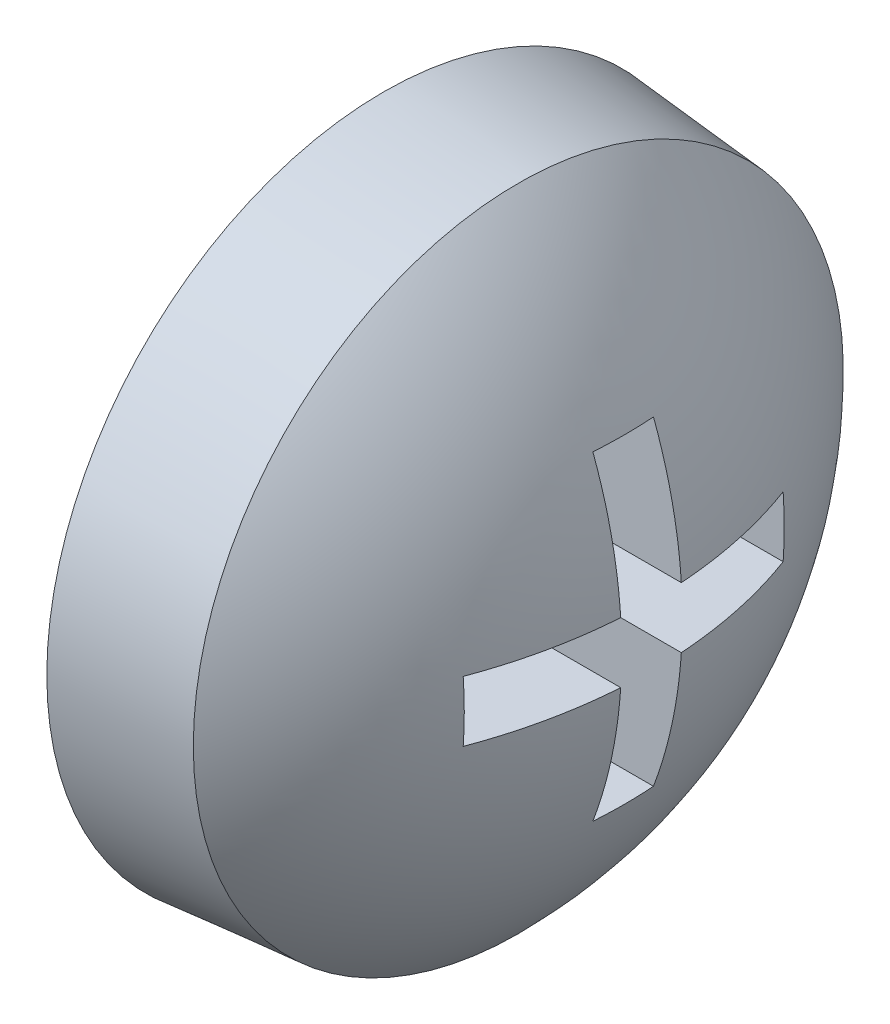
ISO-10303-21;
HEADER;
FILE_DESCRIPTION(('STEP AP214'),'2;1');
FILE_NAME('part.step','',(''),(''),'','','');
FILE_SCHEMA(('AUTOMOTIVE_DESIGN { 1 0 10303 214 1 1 1 1 }'));
ENDSEC;
DATA;
#1=APPLICATION_CONTEXT('core data for automotive mechanical design processes');
#2=APPLICATION_PROTOCOL_DEFINITION('international standard','automotive_design',2000,#1);
#3=PRODUCT_CONTEXT('',#1,'mechanical');
#4=PRODUCT('Part','Part','',(#3));
#5=PRODUCT_RELATED_PRODUCT_CATEGORY('part','',(#4));
#6=PRODUCT_DEFINITION_FORMATION('','',#4);
#7=PRODUCT_DEFINITION_CONTEXT('part definition',#1,'design');
#8=PRODUCT_DEFINITION('design','',#6,#7);
#9=PRODUCT_DEFINITION_SHAPE('','',#8);
#10=(LENGTH_UNIT() NAMED_UNIT(*) SI_UNIT(.MILLI.,.METRE.));
#11=(NAMED_UNIT(*) PLANE_ANGLE_UNIT() SI_UNIT($,.RADIAN.));
#12=(NAMED_UNIT(*) SI_UNIT($,.STERADIAN.) SOLID_ANGLE_UNIT());
#13=UNCERTAINTY_MEASURE_WITH_UNIT(LENGTH_MEASURE(1.E-05),#10,'distance_accuracy_value','');
#14=(GEOMETRIC_REPRESENTATION_CONTEXT(3) GLOBAL_UNCERTAINTY_ASSIGNED_CONTEXT((#13)) GLOBAL_UNIT_ASSIGNED_CONTEXT((#10,
#11,#12)) REPRESENTATION_CONTEXT('',''));
#15=CARTESIAN_POINT('',(0.,0.,0.));
#16=DIRECTION('',(0.,0.,1.));
#17=DIRECTION('',(1.,0.,0.));
#18=AXIS2_PLACEMENT_3D('',#15,#16,#17);
#19=CARTESIAN_POINT('',(103.933333333333,6.9,10.));
#20=DIRECTION('',(1.,0.,0.));
#21=DIRECTION('',(0.,0.,-1.));
#22=AXIS2_PLACEMENT_3D('',#19,#20,#21);
#23=PLANE('',#22);
#24=DIRECTION('',(0.,0.,1.));
#25=VECTOR('',#24,1.);
#26=CARTESIAN_POINT('',(103.933333333333,5.95,10.));
#27=LINE('',#26,#25);
#28=CARTESIAN_POINT('',(103.933333333333,5.95,9.82));
#29=VERTEX_POINT('',#28);
#30=CARTESIAN_POINT('',(103.933333333333,5.95,10.18));
#31=VERTEX_POINT('',#30);
#32=EDGE_CURVE('E293',#29,#31,#27,.T.);
#33=ORIENTED_EDGE('',*,*,#32,.F.);
#34=DIRECTION('',(0.,1.,0.));
#35=VECTOR('',#34,1.);
#36=CARTESIAN_POINT('',(103.933333333333,6.9,9.82));
#37=LINE('',#36,#35);
#38=CARTESIAN_POINT('',(103.933333333333,6.72,9.82));
#39=VERTEX_POINT('',#38);
#40=EDGE_CURVE('E298',#39,#29,#37,.F.);
#41=ORIENTED_EDGE('',*,*,#40,.F.);
#42=DIRECTION('',(0.,0.,1.));
#43=VECTOR('',#42,1.);
#44=CARTESIAN_POINT('',(103.933333333333,6.72,10.));
#45=LINE('',#44,#43);
#46=CARTESIAN_POINT('',(103.933333333333,6.72,9.05));
#47=VERTEX_POINT('',#46);
#48=EDGE_CURVE('E303',#47,#39,#45,.T.);
#49=ORIENTED_EDGE('',*,*,#48,.F.);
#50=DIRECTION('',(0.,1.,0.));
#51=VECTOR('',#50,1.);
#52=CARTESIAN_POINT('',(103.933333333333,6.9,9.05));
#53=LINE('',#52,#51);
#54=CARTESIAN_POINT('',(103.933333333333,7.08,9.05));
#55=VERTEX_POINT('',#54);
#56=EDGE_CURVE('E308',#55,#47,#53,.F.);
#57=ORIENTED_EDGE('',*,*,#56,.F.);
#58=DIRECTION('',(0.,0.,-1.));
#59=VECTOR('',#58,1.);
#60=CARTESIAN_POINT('',(103.933333333333,7.08,10.));
#61=LINE('',#60,#59);
#62=CARTESIAN_POINT('',(103.933333333333,7.08,9.82));
#63=VERTEX_POINT('',#62);
#64=EDGE_CURVE('E313',#63,#55,#61,.T.);
#65=ORIENTED_EDGE('',*,*,#64,.F.);
#66=DIRECTION('',(0.,1.,0.));
#67=VECTOR('',#66,1.);
#68=CARTESIAN_POINT('',(103.933333333333,6.9,9.82));
#69=LINE('',#68,#67);
#70=CARTESIAN_POINT('',(103.933333333333,7.85,9.82));
#71=VERTEX_POINT('',#70);
#72=EDGE_CURVE('E318',#71,#63,#69,.F.);
#73=ORIENTED_EDGE('',*,*,#72,.F.);
#74=DIRECTION('',(0.,0.,1.));
#75=VECTOR('',#74,1.);
#76=CARTESIAN_POINT('',(103.933333333333,7.85,10.));
#77=LINE('',#76,#75);
#78=CARTESIAN_POINT('',(103.933333333333,7.85,10.18));
#79=VERTEX_POINT('',#78);
#80=EDGE_CURVE('E267',#71,#79,#77,.T.);
#81=ORIENTED_EDGE('',*,*,#80,.T.);
#82=DIRECTION('',(0.,1.,0.));
#83=VECTOR('',#82,1.);
#84=CARTESIAN_POINT('',(103.933333333333,6.9,10.18));
#85=LINE('',#84,#83);
#86=CARTESIAN_POINT('',(103.933333333333,7.08,10.18));
#87=VERTEX_POINT('',#86);
#88=EDGE_CURVE('E264',#87,#79,#85,.T.);
#89=ORIENTED_EDGE('',*,*,#88,.F.);
#90=DIRECTION('',(0.,0.,-1.));
#91=VECTOR('',#90,1.);
#92=CARTESIAN_POINT('',(103.933333333333,7.08,10.));
#93=LINE('',#92,#91);
#94=CARTESIAN_POINT('',(103.933333333333,7.08,10.95));
#95=VERTEX_POINT('',#94);
#96=EDGE_CURVE('E260',#95,#87,#93,.T.);
#97=ORIENTED_EDGE('',*,*,#96,.F.);
#98=DIRECTION('',(0.,1.,0.));
#99=VECTOR('',#98,1.);
#100=CARTESIAN_POINT('',(103.933333333333,6.9,10.95));
#101=LINE('',#100,#99);
#102=CARTESIAN_POINT('',(103.933333333333,6.72,10.95));
#103=VERTEX_POINT('',#102);
#104=EDGE_CURVE('E231',#95,#103,#101,.F.);
#105=ORIENTED_EDGE('',*,*,#104,.T.);
#106=DIRECTION('',(0.,0.,1.));
#107=VECTOR('',#106,1.);
#108=CARTESIAN_POINT('',(103.933333333333,6.72,10.));
#109=LINE('',#108,#107);
#110=CARTESIAN_POINT('',(103.933333333333,6.72,10.18));
#111=VERTEX_POINT('',#110);
#112=EDGE_CURVE('E278',#111,#103,#109,.T.);
#113=ORIENTED_EDGE('',*,*,#112,.F.);
#114=DIRECTION('',(0.,1.,0.));
#115=VECTOR('',#114,1.);
#116=CARTESIAN_POINT('',(103.933333333333,6.9,10.18));
#117=LINE('',#116,#115);
#118=EDGE_CURVE('E288',#31,#111,#117,.T.);
#119=ORIENTED_EDGE('',*,*,#118,.F.);
#120=EDGE_LOOP('',(#33,#41,#49,#57,#65,#73,#81,#89,#97,#105,#113,#119));
#121=FACE_BOUND('',#120,.T.);
#122=ADVANCED_FACE('F17',(#121),#23,.T.);
#123=CARTESIAN_POINT('',(104.533333333333,7.08,10.));
#124=DIRECTION('',(0.,-1.,0.));
#125=DIRECTION('',(0.,0.,-1.));
#126=AXIS2_PLACEMENT_3D('',#123,#124,#125);
#127=PLANE('',#126);
#128=DIRECTION('',(1.,0.,0.));
#129=VECTOR('',#128,1.);
#130=CARTESIAN_POINT('',(104.533333333333,7.08,10.95));
#131=LINE('',#130,#129);
#132=CARTESIAN_POINT('',(104.956237856524,7.08,10.9500000000001));
#133=VERTEX_POINT('',#132);
#134=EDGE_CURVE('E89',#133,#95,#131,.F.);
#135=ORIENTED_EDGE('',*,*,#134,.T.);
#136=ORIENTED_EDGE('',*,*,#96,.T.);
#137=DIRECTION('',(-1.,0.,0.));
#138=VECTOR('',#137,1.);
#139=CARTESIAN_POINT('',(104.533333333333,7.08,10.18));
#140=LINE('',#139,#138);
#141=CARTESIAN_POINT('',(105.121430903127,7.08000000000001,10.18));
#142=VERTEX_POINT('',#141);
#143=EDGE_CURVE('E224',#142,#87,#140,.T.);
#144=ORIENTED_EDGE('',*,*,#143,.F.);
#145=CARTESIAN_POINT('',(104.956237856524,7.08,10.9500000000001));
#146=CARTESIAN_POINT('',(104.967782870718,7.08,10.9189995540507));
#147=CARTESIAN_POINT('',(104.978762253102,7.08,10.8877884938069));
#148=CARTESIAN_POINT('',(104.99953545164,7.08,10.825110453647));
#149=CARTESIAN_POINT('',(105.009333758651,7.08,10.7936449620742));
#150=CARTESIAN_POINT('',(105.027757299291,7.08,10.7304618501357));
#151=CARTESIAN_POINT('',(105.03638553892,7.08,10.6987451062673));
#152=CARTESIAN_POINT('',(105.052477288087,7.08,10.6350619663156));
#153=CARTESIAN_POINT('',(105.059942316909,7.08,10.6030959541243));
#154=CARTESIAN_POINT('',(105.073711495295,7.08,10.5389148788569));
#155=CARTESIAN_POINT('',(105.08001564486,7.08,10.5066998157809));
#156=CARTESIAN_POINT('',(105.091462392225,7.08,10.4420201537525));
#157=CARTESIAN_POINT('',(105.096603446971,7.08,10.4095552817086));
#158=CARTESIAN_POINT('',(105.105718495644,7.08,10.3443751591894));
#159=CARTESIAN_POINT('',(105.109689388573,7.08,10.3116594750373));
#160=CARTESIAN_POINT('',(105.116454375482,7.08,10.2459761632456));
#161=CARTESIAN_POINT('',(105.119243763301,7.08,10.2130080508538));
#162=CARTESIAN_POINT('',(105.121430903127,7.08,10.18));
#163=B_SPLINE_CURVE_WITH_KNOTS('',3,(#145,#146,#147,#148,#149,#150,#151,#152,#153,#154,#155,
#156,#157,#158,#159,#160,#161,#162),.UNSPECIFIED.,.F.,.F.,(4,2,2,2,2,2,2,2,4),(0.,
0.0992357442434335,0.1980813876393,0.296668072480546,0.395124892694165,0.49358171290778,
0.592168397749024,0.691014041144891,0.790249785388328),.UNSPECIFIED.);
#164=EDGE_CURVE('E20',#133,#142,#163,.T.);
#165=ORIENTED_EDGE('',*,*,#164,.F.);
#166=EDGE_LOOP('',(#135,#136,#144,#165));
#167=FACE_BOUND('',#166,.T.);
#168=ADVANCED_FACE('F221',(#167),#127,.T.);
#169=CARTESIAN_POINT('',(104.533333333333,6.9,10.18));
#170=DIRECTION('',(0.,0.,-1.));
#171=DIRECTION('',(-1.,0.,0.));
#172=AXIS2_PLACEMENT_3D('',#169,#170,#171);
#173=PLANE('',#172);
#174=ORIENTED_EDGE('',*,*,#88,.T.);
#175=DIRECTION('',(1.,0.,0.));
#176=VECTOR('',#175,1.);
#177=CARTESIAN_POINT('',(104.533333333333,7.85,10.18));
#178=LINE('',#177,#176);
#179=CARTESIAN_POINT('',(104.956237856524,7.85,10.18));
#180=VERTEX_POINT('',#179);
#181=EDGE_CURVE('E324',#79,#180,#178,.T.);
#182=ORIENTED_EDGE('',*,*,#181,.T.);
#183=CARTESIAN_POINT('',(105.121430903127,7.08000000000003,10.18));
#184=CARTESIAN_POINT('',(105.115776724439,7.16559008255585,10.18));
#185=CARTESIAN_POINT('',(105.106045237039,7.25090347737772,10.18));
#186=CARTESIAN_POINT('',(105.078678119522,7.41965906159773,10.18));
#187=CARTESIAN_POINT('',(105.061096565483,7.503110019482,10.18));
#188=CARTESIAN_POINT('',(105.01636743592,7.67504249159054,10.18));
#189=CARTESIAN_POINT('',(104.988531372825,7.76334531100357,10.18));
#190=CARTESIAN_POINT('',(104.956237856524,7.85000000000015,10.18));
#191=B_SPLINE_CURVE_WITH_KNOTS('',3,(#183,#184,#185,#186,#187,#188,#189,#190),.UNSPECIFIED.,.F.,
.F.,(4,2,2,4),(0.,0.257221658829357,0.512698117737388,0.78998348623174),.UNSPECIFIED.);
#192=EDGE_CURVE('E213',#142,#180,#191,.T.);
#193=ORIENTED_EDGE('',*,*,#192,.F.);
#194=ORIENTED_EDGE('',*,*,#143,.T.);
#195=EDGE_LOOP('',(#174,#182,#193,#194));
#196=FACE_BOUND('',#195,.T.);
#197=ADVANCED_FACE('F204',(#196),#173,.T.);
#198=CARTESIAN_POINT('',(104.533333333333,7.85,10.));
#199=DIRECTION('',(0.,1.,0.));
#200=DIRECTION('',(0.,0.,1.));
#201=AXIS2_PLACEMENT_3D('',#198,#199,#200);
#202=PLANE('',#201);
#203=ORIENTED_EDGE('',*,*,#181,.F.);
#204=ORIENTED_EDGE('',*,*,#80,.F.);
#205=DIRECTION('',(1.,0.,0.));
#206=VECTOR('',#205,1.);
#207=CARTESIAN_POINT('',(104.533333333333,7.85,9.82));
#208=LINE('',#207,#206);
#209=CARTESIAN_POINT('',(104.956237856524,7.85000000000007,9.82));
#210=VERTEX_POINT('',#209);
#211=EDGE_CURVE('E320',#210,#71,#208,.F.);
#212=ORIENTED_EDGE('',*,*,#211,.F.);
#213=CARTESIAN_POINT('',(104.956237856524,7.85,10.18));
#214=CARTESIAN_POINT('',(104.960466252223,7.85000000000002,10.12));
#215=CARTESIAN_POINT('',(104.962580450072,7.85000000000002,10.06));
#216=CARTESIAN_POINT('',(104.962580450072,7.84999999999998,9.93999999999995));
#217=CARTESIAN_POINT('',(104.960466252223,7.84999999999994,9.87999999999993));
#218=CARTESIAN_POINT('',(104.956237856524,7.84999999999989,9.81999999999991));
#219=B_SPLINE_CURVE_WITH_KNOTS('',3,(#213,#214,#215,#216,#217,#218),.UNSPECIFIED.,.F.,.F.,(4,2,
4),(0.,0.18011171114875,0.3602234222975),.UNSPECIFIED.);
#220=EDGE_CURVE('E207',#180,#210,#219,.T.);
#221=ORIENTED_EDGE('',*,*,#220,.F.);
#222=EDGE_LOOP('',(#203,#204,#212,#221));
#223=FACE_BOUND('',#222,.T.);
#224=ADVANCED_FACE('F199',(#223),#202,.F.);
#225=CARTESIAN_POINT('',(104.533333333333,6.9,9.82));
#226=DIRECTION('',(0.,0.,1.));
#227=DIRECTION('',(1.,0.,0.));
#228=AXIS2_PLACEMENT_3D('',#225,#226,#227);
#229=PLANE('',#228);
#230=ORIENTED_EDGE('',*,*,#72,.T.);
#231=DIRECTION('',(1.,0.,0.));
#232=VECTOR('',#231,1.);
#233=CARTESIAN_POINT('',(104.533333333333,7.08,9.82));
#234=LINE('',#233,#232);
#235=CARTESIAN_POINT('',(105.121430903127,7.08,9.81999999999999));
#236=VERTEX_POINT('',#235);
#237=EDGE_CURVE('E315',#236,#63,#234,.F.);
#238=ORIENTED_EDGE('',*,*,#237,.F.);
#239=CARTESIAN_POINT('',(104.956237856524,7.85000000000014,9.82));
#240=CARTESIAN_POINT('',(104.967782870718,7.81899955405072,9.82));
#241=CARTESIAN_POINT('',(104.978762253102,7.78778849380686,9.82));
#242=CARTESIAN_POINT('',(104.99953545164,7.72511045364697,9.82));
#243=CARTESIAN_POINT('',(105.009333758651,7.69364496207417,9.82));
#244=CARTESIAN_POINT('',(105.027757299291,7.6304618501357,9.82));
#245=CARTESIAN_POINT('',(105.03638553892,7.59874510626734,9.82));
#246=CARTESIAN_POINT('',(105.052477288087,7.53506196631559,9.82));
#247=CARTESIAN_POINT('',(105.059942316909,7.50309595412427,9.82));
#248=CARTESIAN_POINT('',(105.073711495295,7.43891487885691,9.82));
#249=CARTESIAN_POINT('',(105.08001564486,7.40669981578087,9.82));
#250=CARTESIAN_POINT('',(105.091462392225,7.34202015375245,9.82));
#251=CARTESIAN_POINT('',(105.096603446971,7.30955528170862,9.82));
#252=CARTESIAN_POINT('',(105.105718495644,7.24437515918937,9.82));
#253=CARTESIAN_POINT('',(105.109689388573,7.21165947503727,9.82));
#254=CARTESIAN_POINT('',(105.116454375482,7.14597616324563,9.82));
#255=CARTESIAN_POINT('',(105.119243763301,7.11300805085381,9.82));
#256=CARTESIAN_POINT('',(105.121430903127,7.08000000000002,9.82));
#257=B_SPLINE_CURVE_WITH_KNOTS('',3,(#239,#240,#241,#242,#243,#244,#245,#246,#247,#248,#249,
#250,#251,#252,#253,#254,#255,#256),.UNSPECIFIED.,.F.,.F.,(4,2,2,2,2,2,2,2,4),(0.,
0.0992357442434318,0.198081387639299,0.29666807248055,0.395124892694164,0.49358171290778,
0.592168397749022,0.69101404114489,0.790249785388327),.UNSPECIFIED.);
#258=EDGE_CURVE('E184',#210,#236,#257,.T.);
#259=ORIENTED_EDGE('',*,*,#258,.F.);
#260=ORIENTED_EDGE('',*,*,#211,.T.);
#261=EDGE_LOOP('',(#230,#238,#259,#260));
#262=FACE_BOUND('',#261,.T.);
#263=ADVANCED_FACE('F194',(#262),#229,.T.);
#264=CARTESIAN_POINT('',(104.533333333333,7.08,10.));
#265=DIRECTION('',(0.,-1.,0.));
#266=DIRECTION('',(0.,0.,-1.));
#267=AXIS2_PLACEMENT_3D('',#264,#265,#266);
#268=PLANE('',#267);
#269=DIRECTION('',(1.,0.,0.));
#270=VECTOR('',#269,1.);
#271=CARTESIAN_POINT('',(104.533333333333,7.08,9.05));
#272=LINE('',#271,#270);
#273=CARTESIAN_POINT('',(104.956237856524,7.08,9.05));
#274=VERTEX_POINT('',#273);
#275=EDGE_CURVE('E310',#274,#55,#272,.F.);
#276=ORIENTED_EDGE('',*,*,#275,.F.);
#277=CARTESIAN_POINT('',(105.121430903127,7.08,9.81999999999998));
#278=CARTESIAN_POINT('',(105.115776724439,7.08,9.73440991744416));
#279=CARTESIAN_POINT('',(105.106045237039,7.08,9.64909652262228));
#280=CARTESIAN_POINT('',(105.078678119522,7.08,9.48034093840228));
#281=CARTESIAN_POINT('',(105.061096565483,7.08,9.396889980518));
#282=CARTESIAN_POINT('',(105.01636743592,7.08,9.22495750840947));
#283=CARTESIAN_POINT('',(104.988531372825,7.08,9.13665468899644));
#284=CARTESIAN_POINT('',(104.956237856524,7.08,9.04999999999986));
#285=B_SPLINE_CURVE_WITH_KNOTS('',3,(#277,#278,#279,#280,#281,#282,#283,#284),.UNSPECIFIED.,.F.,
.F.,(4,2,2,4),(0.,0.257221658829355,0.512698117737384,0.789983486231741),.UNSPECIFIED.);
#286=EDGE_CURVE('E176',#236,#274,#285,.T.);
#287=ORIENTED_EDGE('',*,*,#286,.F.);
#288=ORIENTED_EDGE('',*,*,#237,.T.);
#289=ORIENTED_EDGE('',*,*,#64,.T.);
#290=EDGE_LOOP('',(#276,#287,#288,#289));
#291=FACE_BOUND('',#290,.T.);
#292=ADVANCED_FACE('F191',(#291),#268,.T.);
#293=CARTESIAN_POINT('',(104.533333333333,6.9,9.05));
#294=DIRECTION('',(0.,0.,1.));
#295=DIRECTION('',(1.,0.,0.));
#296=AXIS2_PLACEMENT_3D('',#293,#294,#295);
#297=PLANE('',#296);
#298=DIRECTION('',(1.,0.,0.));
#299=VECTOR('',#298,1.);
#300=CARTESIAN_POINT('',(104.533333333333,6.72,9.05));
#301=LINE('',#300,#299);
#302=CARTESIAN_POINT('',(104.956237856524,6.72,9.04999999999993));
#303=VERTEX_POINT('',#302);
#304=EDGE_CURVE('E305',#303,#47,#301,.F.);
#305=ORIENTED_EDGE('',*,*,#304,.F.);
#306=CARTESIAN_POINT('',(104.956237856524,6.72,9.05));
#307=CARTESIAN_POINT('',(104.962580450072,6.80988825418749,9.05));
#308=CARTESIAN_POINT('',(104.962580450072,6.9,9.05));
#309=B_SPLINE_CURVE_WITH_KNOTS('',2,(#306,#307,#308),.UNSPECIFIED.,.F.,.F.,(3,3),(0.,1.),.UNSPECIFIED.);
#310=CARTESIAN_POINT('',(104.962580450072,6.9,9.05));
#311=VERTEX_POINT('',#310);
#312=EDGE_CURVE('E175',#311,#303,#309,.F.);
#313=ORIENTED_EDGE('',*,*,#312,.F.);
#314=CARTESIAN_POINT('',(104.962580450072,6.9,9.05));
#315=CARTESIAN_POINT('',(104.962580450072,6.99011174581251,9.05));
#316=CARTESIAN_POINT('',(104.956237856524,7.08,9.05));
#317=B_SPLINE_CURVE_WITH_KNOTS('',2,(#314,#315,#316),.UNSPECIFIED.,.F.,.F.,(3,3),(0.,1.),.UNSPECIFIED.);
#318=EDGE_CURVE('E183',#274,#311,#317,.F.);
#319=ORIENTED_EDGE('',*,*,#318,.F.);
#320=ORIENTED_EDGE('',*,*,#275,.T.);
#321=ORIENTED_EDGE('',*,*,#56,.T.);
#322=EDGE_LOOP('',(#305,#313,#319,#320,#321));
#323=FACE_BOUND('',#322,.T.);
#324=ADVANCED_FACE('F164',(#323),#297,.T.);
#325=CARTESIAN_POINT('',(104.533333333333,6.72,10.));
#326=DIRECTION('',(0.,1.,0.));
#327=DIRECTION('',(0.,0.,1.));
#328=AXIS2_PLACEMENT_3D('',#325,#326,#327);
#329=PLANE('',#328);
#330=ORIENTED_EDGE('',*,*,#304,.T.);
#331=ORIENTED_EDGE('',*,*,#48,.T.);
#332=DIRECTION('',(1.,0.,0.));
#333=VECTOR('',#332,1.);
#334=CARTESIAN_POINT('',(104.533333333333,6.72,9.82));
#335=LINE('',#334,#333);
#336=CARTESIAN_POINT('',(105.121430903127,6.71999999999999,9.82));
#337=VERTEX_POINT('',#336);
#338=EDGE_CURVE('E300',#337,#39,#335,.F.);
#339=ORIENTED_EDGE('',*,*,#338,.F.);
#340=CARTESIAN_POINT('',(104.956237856524,6.72,9.04999999999986));
#341=CARTESIAN_POINT('',(104.967782870718,6.72,9.08100044594928));
#342=CARTESIAN_POINT('',(104.978762253102,6.72,9.11221150619314));
#343=CARTESIAN_POINT('',(104.99953545164,6.72,9.17488954635303));
#344=CARTESIAN_POINT('',(105.009333758651,6.72,9.20635503792583));
#345=CARTESIAN_POINT('',(105.027757299291,6.72,9.2695381498643));
#346=CARTESIAN_POINT('',(105.03638553892,6.72,9.30125489373266));
#347=CARTESIAN_POINT('',(105.052477288087,6.72,9.3649380336844));
#348=CARTESIAN_POINT('',(105.059942316909,6.72,9.39690404587573));
#349=CARTESIAN_POINT('',(105.073711495295,6.72,9.4610851211431));
#350=CARTESIAN_POINT('',(105.08001564486,6.72,9.49330018421913));
#351=CARTESIAN_POINT('',(105.091462392225,6.72,9.55797984624755));
#352=CARTESIAN_POINT('',(105.096603446971,6.72,9.59044471829137));
#353=CARTESIAN_POINT('',(105.105718495644,6.72,9.65562484081063));
#354=CARTESIAN_POINT('',(105.109689388573,6.72,9.68834052496273));
#355=CARTESIAN_POINT('',(105.116454375482,6.72,9.75402383675437));
#356=CARTESIAN_POINT('',(105.119243763301,6.72,9.78699194914619));
#357=CARTESIAN_POINT('',(105.121430903127,6.72,9.81999999999998));
#358=B_SPLINE_CURVE_WITH_KNOTS('',3,(#340,#341,#342,#343,#344,#345,#346,#347,#348,#349,#350,
#351,#352,#353,#354,#355,#356,#357),.UNSPECIFIED.,.F.,.F.,(4,2,2,2,2,2,2,2,4),(0.,
0.0992357442434335,0.1980813876393,0.296668072480546,0.395124892694165,0.493581712907782,
0.592168397749024,0.691014041144893,0.790249785388328),.UNSPECIFIED.);
#359=EDGE_CURVE('E168',#303,#337,#358,.T.);
#360=ORIENTED_EDGE('',*,*,#359,.F.);
#361=EDGE_LOOP('',(#330,#331,#339,#360));
#362=FACE_BOUND('',#361,.T.);
#363=ADVANCED_FACE('F159',(#362),#329,.T.);
#364=CARTESIAN_POINT('',(104.533333333333,6.9,9.82));
#365=DIRECTION('',(0.,0.,1.));
#366=DIRECTION('',(1.,0.,0.));
#367=AXIS2_PLACEMENT_3D('',#364,#365,#366);
#368=PLANE('',#367);
#369=ORIENTED_EDGE('',*,*,#40,.T.);
#370=DIRECTION('',(1.,0.,0.));
#371=VECTOR('',#370,1.);
#372=CARTESIAN_POINT('',(104.533333333333,5.95,9.82));
#373=LINE('',#372,#371);
#374=CARTESIAN_POINT('',(104.956237856524,5.95,9.81999999999998));
#375=VERTEX_POINT('',#374);
#376=EDGE_CURVE('E295',#375,#29,#373,.F.);
#377=ORIENTED_EDGE('',*,*,#376,.F.);
#378=CARTESIAN_POINT('',(105.121430903127,6.71999999999997,9.82));
#379=CARTESIAN_POINT('',(105.115776724439,6.63440991744415,9.82));
#380=CARTESIAN_POINT('',(105.106045237039,6.54909652262228,9.82));
#381=CARTESIAN_POINT('',(105.078678119522,6.38034093840227,9.82));
#382=CARTESIAN_POINT('',(105.061096565483,6.296889980518,9.82));
#383=CARTESIAN_POINT('',(105.01636743592,6.12495750840946,9.82));
#384=CARTESIAN_POINT('',(104.988531372825,6.03665468899643,9.82));
#385=CARTESIAN_POINT('',(104.956237856524,5.94999999999985,9.82));
#386=B_SPLINE_CURVE_WITH_KNOTS('',3,(#378,#379,#380,#381,#382,#383,#384,#385),.UNSPECIFIED.,.F.,
.F.,(4,2,2,4),(0.,0.257221658829357,0.512698117737388,0.78998348623174),.UNSPECIFIED.);
#387=EDGE_CURVE('E144',#337,#375,#386,.T.);
#388=ORIENTED_EDGE('',*,*,#387,.F.);
#389=ORIENTED_EDGE('',*,*,#338,.T.);
#390=EDGE_LOOP('',(#369,#377,#388,#389));
#391=FACE_BOUND('',#390,.T.);
#392=ADVANCED_FACE('F154',(#391),#368,.T.);
#393=CARTESIAN_POINT('',(104.533333333333,5.95,10.));
#394=DIRECTION('',(0.,1.,0.));
#395=DIRECTION('',(0.,0.,1.));
#396=AXIS2_PLACEMENT_3D('',#393,#394,#395);
#397=PLANE('',#396);
#398=ORIENTED_EDGE('',*,*,#32,.T.);
#399=DIRECTION('',(-1.,0.,0.));
#400=VECTOR('',#399,1.);
#401=CARTESIAN_POINT('',(104.533333333333,5.95,10.18));
#402=LINE('',#401,#400);
#403=CARTESIAN_POINT('',(104.956237856524,5.94999999999993,10.18));
#404=VERTEX_POINT('',#403);
#405=EDGE_CURVE('E290',#404,#31,#402,.T.);
#406=ORIENTED_EDGE('',*,*,#405,.F.);
#407=CARTESIAN_POINT('',(104.956237856524,5.95,9.81999999999997));
#408=CARTESIAN_POINT('',(104.960466252223,5.94999999999999,9.87999999999999));
#409=CARTESIAN_POINT('',(104.962580450072,5.94999999999999,9.94000000000001));
#410=CARTESIAN_POINT('',(104.962580450072,5.95000000000001,10.0600000000001));
#411=CARTESIAN_POINT('',(104.960466252223,5.95000000000003,10.1200000000001));
#412=CARTESIAN_POINT('',(104.956237856524,5.95000000000006,10.1800000000001));
#413=B_SPLINE_CURVE_WITH_KNOTS('',3,(#407,#408,#409,#410,#411,#412),.UNSPECIFIED.,.F.,.F.,(4,2,
4),(0.,0.180111711148751,0.3602234222975),.UNSPECIFIED.);
#414=EDGE_CURVE('E137',#375,#404,#413,.T.);
#415=ORIENTED_EDGE('',*,*,#414,.F.);
#416=ORIENTED_EDGE('',*,*,#376,.T.);
#417=EDGE_LOOP('',(#398,#406,#415,#416));
#418=FACE_BOUND('',#417,.T.);
#419=ADVANCED_FACE('F151',(#418),#397,.T.);
#420=CARTESIAN_POINT('',(104.533333333333,6.9,10.18));
#421=DIRECTION('',(0.,0.,-1.));
#422=DIRECTION('',(-1.,0.,0.));
#423=AXIS2_PLACEMENT_3D('',#420,#421,#422);
#424=PLANE('',#423);
#425=ORIENTED_EDGE('',*,*,#118,.T.);
#426=DIRECTION('',(1.,0.,0.));
#427=VECTOR('',#426,1.);
#428=CARTESIAN_POINT('',(104.533333333333,6.72,10.18));
#429=LINE('',#428,#427);
#430=CARTESIAN_POINT('',(105.121430903127,6.72,10.18));
#431=VERTEX_POINT('',#430);
#432=EDGE_CURVE('E280',#431,#111,#429,.F.);
#433=ORIENTED_EDGE('',*,*,#432,.F.);
#434=CARTESIAN_POINT('',(104.956237856524,5.94999999999986,10.18));
#435=CARTESIAN_POINT('',(104.967782870718,5.98100044594928,10.18));
#436=CARTESIAN_POINT('',(104.978762253102,6.01221150619314,10.18));
#437=CARTESIAN_POINT('',(104.99953545164,6.07488954635303,10.18));
#438=CARTESIAN_POINT('',(105.009333758651,6.10635503792583,10.18));
#439=CARTESIAN_POINT('',(105.027757299291,6.1695381498643,10.18));
#440=CARTESIAN_POINT('',(105.03638553892,6.20125489373266,10.18));
#441=CARTESIAN_POINT('',(105.052477288087,6.26493803368441,10.18));
#442=CARTESIAN_POINT('',(105.059942316909,6.29690404587573,10.18));
#443=CARTESIAN_POINT('',(105.073711495295,6.3610851211431,10.18));
#444=CARTESIAN_POINT('',(105.08001564486,6.39330018421913,10.18));
#445=CARTESIAN_POINT('',(105.091462392225,6.45797984624755,10.18));
#446=CARTESIAN_POINT('',(105.096603446971,6.49044471829137,10.18));
#447=CARTESIAN_POINT('',(105.105718495644,6.55562484081063,10.18));
#448=CARTESIAN_POINT('',(105.109689388573,6.58834052496273,10.18));
#449=CARTESIAN_POINT('',(105.116454375482,6.65402383675436,10.18));
#450=CARTESIAN_POINT('',(105.119243763301,6.68699194914619,10.18));
#451=CARTESIAN_POINT('',(105.121430903127,6.71999999999998,10.18));
#452=B_SPLINE_CURVE_WITH_KNOTS('',3,(#434,#435,#436,#437,#438,#439,#440,#441,#442,#443,#444,
#445,#446,#447,#448,#449,#450,#451),.UNSPECIFIED.,.F.,.F.,(4,2,2,2,2,2,2,2,4),(0.,
0.0992357442434335,0.198081387639302,0.296668072480547,0.395124892694165,0.493581712907781,
0.592168397749024,0.691014041144891,0.790249785388326),.UNSPECIFIED.);
#453=EDGE_CURVE('E100',#404,#431,#452,.T.);
#454=ORIENTED_EDGE('',*,*,#453,.F.);
#455=ORIENTED_EDGE('',*,*,#405,.T.);
#456=EDGE_LOOP('',(#425,#433,#454,#455));
#457=FACE_BOUND('',#456,.T.);
#458=ADVANCED_FACE('F123',(#457),#424,.T.);
#459=CARTESIAN_POINT('',(104.533333333333,6.72,10.));
#460=DIRECTION('',(0.,1.,0.));
#461=DIRECTION('',(0.,0.,1.));
#462=AXIS2_PLACEMENT_3D('',#459,#460,#461);
#463=PLANE('',#462);
#464=DIRECTION('',(1.,0.,0.));
#465=VECTOR('',#464,1.);
#466=CARTESIAN_POINT('',(104.533333333333,6.72,10.95));
#467=LINE('',#466,#465);
#468=CARTESIAN_POINT('',(104.956237856524,6.72,10.95));
#469=VERTEX_POINT('',#468);
#470=EDGE_CURVE('E40',#103,#469,#467,.T.);
#471=ORIENTED_EDGE('',*,*,#470,.T.);
#472=CARTESIAN_POINT('',(105.121430903127,6.72,10.18));
#473=CARTESIAN_POINT('',(105.115776724439,6.72,10.2655900825559));
#474=CARTESIAN_POINT('',(105.106045237039,6.72,10.3509034773777));
#475=CARTESIAN_POINT('',(105.078678119522,6.72,10.5196590615977));
#476=CARTESIAN_POINT('',(105.061096565483,6.72,10.603110019482));
#477=CARTESIAN_POINT('',(105.01636743592,6.72,10.7750424915905));
#478=CARTESIAN_POINT('',(104.988531372825,6.72,10.8633453110036));
#479=CARTESIAN_POINT('',(104.956237856524,6.72,10.9500000000001));
#480=B_SPLINE_CURVE_WITH_KNOTS('',3,(#472,#473,#474,#475,#476,#477,#478,#479),.UNSPECIFIED.,.F.,
.F.,(4,2,2,4),(0.,0.25722165882936,0.512698117737391,0.789983486231741),.UNSPECIFIED.);
#481=EDGE_CURVE('E96',#431,#469,#480,.T.);
#482=ORIENTED_EDGE('',*,*,#481,.F.);
#483=ORIENTED_EDGE('',*,*,#432,.T.);
#484=ORIENTED_EDGE('',*,*,#112,.T.);
#485=EDGE_LOOP('',(#471,#482,#483,#484));
#486=FACE_BOUND('',#485,.T.);
#487=ADVANCED_FACE('F115',(#486),#463,.T.);
#488=CARTESIAN_POINT('',(104.533333333333,6.9,10.95));
#489=DIRECTION('',(0.,0.,1.));
#490=DIRECTION('',(1.,0.,0.));
#491=AXIS2_PLACEMENT_3D('',#488,#489,#490);
#492=PLANE('',#491);
#493=ORIENTED_EDGE('',*,*,#470,.F.);
#494=ORIENTED_EDGE('',*,*,#104,.F.);
#495=ORIENTED_EDGE('',*,*,#134,.F.);
#496=CARTESIAN_POINT('',(104.962580450072,6.9,10.95));
#497=CARTESIAN_POINT('',(104.962580450072,6.99011174581251,10.95));
#498=CARTESIAN_POINT('',(104.956237856524,7.08,10.95));
#499=B_SPLINE_CURVE_WITH_KNOTS('',2,(#496,#497,#498),.UNSPECIFIED.,.F.,.F.,(3,3),(0.,1.),.UNSPECIFIED.);
#500=CARTESIAN_POINT('',(104.962580450072,6.9,10.95));
#501=VERTEX_POINT('',#500);
#502=EDGE_CURVE('E82',#501,#133,#499,.T.);
#503=ORIENTED_EDGE('',*,*,#502,.F.);
#504=CARTESIAN_POINT('',(104.956237856524,6.72,10.95));
#505=CARTESIAN_POINT('',(104.962580450072,6.80988825418749,10.95));
#506=CARTESIAN_POINT('',(104.962580450072,6.9,10.95));
#507=B_SPLINE_CURVE_WITH_KNOTS('',2,(#504,#505,#506),.UNSPECIFIED.,.F.,.F.,(3,3),(0.,1.),.UNSPECIFIED.);
#508=EDGE_CURVE('E85',#469,#501,#507,.T.);
#509=ORIENTED_EDGE('',*,*,#508,.F.);
#510=EDGE_LOOP('',(#493,#494,#495,#503,#509));
#511=FACE_BOUND('',#510,.T.);
#512=ADVANCED_FACE('F84',(#511),#492,.F.);
#513=CARTESIAN_POINT('',(102.405248953887,6.9,10.));
#514=DIRECTION('',(1.,0.,0.));
#515=DIRECTION('',(0.,1.,0.));
#516=AXIS2_PLACEMENT_3D('',#513,#514,#515);
#517=SPHERICAL_SURFACE('',#516,2.72808437944638);
#518=CARTESIAN_POINT('',(104.333333333329,6.9,10.));
#519=DIRECTION('',(-1.,0.,0.));
#520=DIRECTION('',(0.,0.,1.));
#521=AXIS2_PLACEMENT_3D('',#518,#519,#520);
#522=CIRCLE('',#521,1.93000906917518);
#523=CARTESIAN_POINT('',(104.333333333329,6.89999999999993,11.9300090691752));
#524=VERTEX_POINT('',#523);
#525=EDGE_CURVE('E31',#524,#524,#522,.T.);
#526=ORIENTED_EDGE('',*,*,#525,.F.);
#527=EDGE_LOOP('',(#526));
#528=FACE_BOUND('',#527,.T.);
#529=ORIENTED_EDGE('',*,*,#481,.T.);
#530=ORIENTED_EDGE('',*,*,#508,.T.);
#531=ORIENTED_EDGE('',*,*,#502,.T.);
#532=ORIENTED_EDGE('',*,*,#164,.T.);
#533=ORIENTED_EDGE('',*,*,#192,.T.);
#534=ORIENTED_EDGE('',*,*,#220,.T.);
#535=ORIENTED_EDGE('',*,*,#258,.T.);
#536=ORIENTED_EDGE('',*,*,#286,.T.);
#537=ORIENTED_EDGE('',*,*,#318,.T.);
#538=ORIENTED_EDGE('',*,*,#312,.T.);
#539=ORIENTED_EDGE('',*,*,#359,.T.);
#540=ORIENTED_EDGE('',*,*,#387,.T.);
#541=ORIENTED_EDGE('',*,*,#414,.T.);
#542=ORIENTED_EDGE('',*,*,#453,.T.);
#543=EDGE_LOOP('',(#529,#530,#531,#532,#533,#534,#535,#536,#537,#538,#539,#540,#541,#542));
#544=FACE_BOUND('',#543,.T.);
#545=ADVANCED_FACE('F94',(#528,#544),#517,.T.);
#546=CARTESIAN_POINT('',(103.53333333336,6.9,10.));
#547=DIRECTION('',(-1.,0.,0.));
#548=DIRECTION('',(0.,-1.,0.));
#549=AXIS2_PLACEMENT_3D('',#546,#547,#548);
#550=CONICAL_SURFACE('',#549,1.99999999999335,0.0872664625998096);
#551=CARTESIAN_POINT('',(103.53333333336,6.9,10.));
#552=DIRECTION('',(-1.,0.,0.));
#553=DIRECTION('',(0.,-1.,0.));
#554=AXIS2_PLACEMENT_3D('',#551,#552,#553);
#555=CIRCLE('',#554,1.99999999999335);
#556=CARTESIAN_POINT('',(103.53333333336,4.90000000000665,10.));
#557=VERTEX_POINT('',#556);
#558=EDGE_CURVE('E11',#557,#557,#555,.T.);
#559=ORIENTED_EDGE('',*,*,#558,.F.);
#560=EDGE_LOOP('',(#559));
#561=FACE_BOUND('',#560,.T.);
#562=ORIENTED_EDGE('',*,*,#525,.T.);
#563=EDGE_LOOP('',(#562));
#564=FACE_BOUND('',#563,.T.);
#565=ADVANCED_FACE('F402',(#561,#564),#550,.T.);
#566=CARTESIAN_POINT('',(103.533333333333,6.9,11.));
#567=DIRECTION('',(-1.,0.,0.));
#568=DIRECTION('',(0.,0.,1.));
#569=AXIS2_PLACEMENT_3D('',#566,#567,#568);
#570=PLANE('',#569);
#571=ORIENTED_EDGE('',*,*,#558,.T.);
#572=EDGE_LOOP('',(#571));
#573=FACE_BOUND('',#572,.T.);
#574=ADVANCED_FACE('F400',(#573),#570,.T.);
#575=CLOSED_SHELL('',(#122,#168,#197,#224,#263,#292,#324,#363,#392,#419,#458,#487,#512,#545,
#565,#574));
#576=MANIFOLD_SOLID_BREP('B1',#575);
#577=ADVANCED_BREP_SHAPE_REPRESENTATION('',(#18,#576),#14);
#578=SHAPE_DEFINITION_REPRESENTATION(#9,#577);
ENDSEC;
END-ISO-10303-21;
